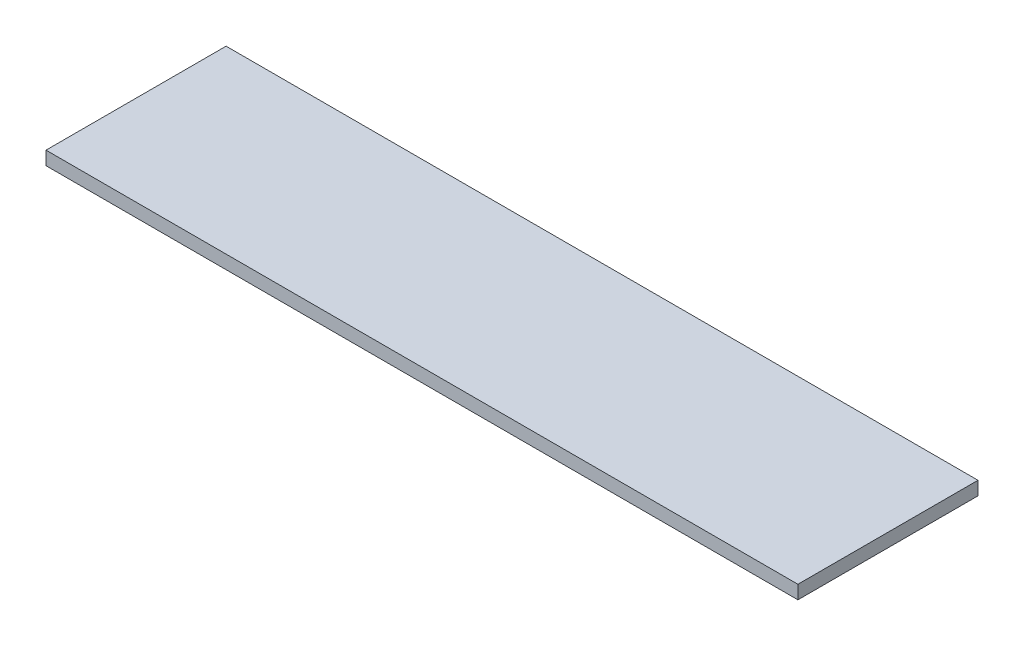
ISO-10303-21;
HEADER;
FILE_DESCRIPTION(('STEP AP214'),'2;1');
FILE_NAME('part.step','',(''),(''),'','','');
FILE_SCHEMA(('AUTOMOTIVE_DESIGN { 1 0 10303 214 1 1 1 1 }'));
ENDSEC;
DATA;
#1=APPLICATION_CONTEXT('core data for automotive mechanical design processes');
#2=APPLICATION_PROTOCOL_DEFINITION('international standard','automotive_design',2000,#1);
#3=PRODUCT_CONTEXT('',#1,'mechanical');
#4=PRODUCT('Part','Part','',(#3));
#5=PRODUCT_RELATED_PRODUCT_CATEGORY('part','',(#4));
#6=PRODUCT_DEFINITION_FORMATION('','',#4);
#7=PRODUCT_DEFINITION_CONTEXT('part definition',#1,'design');
#8=PRODUCT_DEFINITION('design','',#6,#7);
#9=PRODUCT_DEFINITION_SHAPE('','',#8);
#10=(LENGTH_UNIT() NAMED_UNIT(*) SI_UNIT(.MILLI.,.METRE.));
#11=(NAMED_UNIT(*) PLANE_ANGLE_UNIT() SI_UNIT($,.RADIAN.));
#12=(NAMED_UNIT(*) SI_UNIT($,.STERADIAN.) SOLID_ANGLE_UNIT());
#13=UNCERTAINTY_MEASURE_WITH_UNIT(LENGTH_MEASURE(1.E-05),#10,'distance_accuracy_value','');
#14=(GEOMETRIC_REPRESENTATION_CONTEXT(3) GLOBAL_UNCERTAINTY_ASSIGNED_CONTEXT((#13)) GLOBAL_UNIT_ASSIGNED_CONTEXT((#10,
#11,#12)) REPRESENTATION_CONTEXT('',''));
#15=CARTESIAN_POINT('',(0.,0.,0.));
#16=DIRECTION('',(0.,0.,1.));
#17=DIRECTION('',(1.,0.,0.));
#18=AXIS2_PLACEMENT_3D('',#15,#16,#17);
#19=CARTESIAN_POINT('',(530.225,19.05,127.));
#20=DIRECTION('',(-1.,0.,0.));
#21=DIRECTION('',(0.,0.,1.));
#22=AXIS2_PLACEMENT_3D('',#19,#20,#21);
#23=PLANE('',#22);
#24=DIRECTION('',(0.,0.,-1.));
#25=VECTOR('',#24,1.);
#26=CARTESIAN_POINT('',(530.225,0.,127.));
#27=LINE('',#26,#25);
#28=CARTESIAN_POINT('',(530.225,0.,127.));
#29=VERTEX_POINT('',#28);
#30=CARTESIAN_POINT('',(530.225,0.,-127.));
#31=VERTEX_POINT('',#30);
#32=EDGE_CURVE('E96',#29,#31,#27,.T.);
#33=ORIENTED_EDGE('',*,*,#32,.T.);
#34=DIRECTION('',(0.,-1.,0.));
#35=VECTOR('',#34,1.);
#36=CARTESIAN_POINT('',(530.225,19.05,-127.));
#37=LINE('',#36,#35);
#38=CARTESIAN_POINT('',(530.225,19.05,-127.));
#39=VERTEX_POINT('',#38);
#40=EDGE_CURVE('E11',#39,#31,#37,.T.);
#41=ORIENTED_EDGE('',*,*,#40,.F.);
#42=DIRECTION('',(0.,0.,-1.));
#43=VECTOR('',#42,1.);
#44=CARTESIAN_POINT('',(530.225,19.05,127.));
#45=LINE('',#44,#43);
#46=CARTESIAN_POINT('',(530.225,19.05,127.));
#47=VERTEX_POINT('',#46);
#48=EDGE_CURVE('E84',#47,#39,#45,.T.);
#49=ORIENTED_EDGE('',*,*,#48,.F.);
#50=DIRECTION('',(0.,-1.,0.));
#51=VECTOR('',#50,1.);
#52=CARTESIAN_POINT('',(530.225,19.05,127.));
#53=LINE('',#52,#51);
#54=EDGE_CURVE('E92',#47,#29,#53,.T.);
#55=ORIENTED_EDGE('',*,*,#54,.T.);
#56=EDGE_LOOP('',(#33,#41,#49,#55));
#57=FACE_BOUND('',#56,.T.);
#58=ADVANCED_FACE('F33',(#57),#23,.F.);
#59=CARTESIAN_POINT('',(-530.225,19.05,-127.));
#60=DIRECTION('',(0.,0.,1.));
#61=DIRECTION('',(1.,0.,0.));
#62=AXIS2_PLACEMENT_3D('',#59,#60,#61);
#63=PLANE('',#62);
#64=DIRECTION('',(-1.,0.,0.));
#65=VECTOR('',#64,1.);
#66=CARTESIAN_POINT('',(-530.225,0.,-127.));
#67=LINE('',#66,#65);
#68=CARTESIAN_POINT('',(-530.225,0.,-127.));
#69=VERTEX_POINT('',#68);
#70=EDGE_CURVE('E88',#31,#69,#67,.T.);
#71=ORIENTED_EDGE('',*,*,#70,.T.);
#72=DIRECTION('',(0.,-1.,0.));
#73=VECTOR('',#72,1.);
#74=CARTESIAN_POINT('',(-530.225,19.05,-127.));
#75=LINE('',#74,#73);
#76=CARTESIAN_POINT('',(-530.225,19.05,-127.));
#77=VERTEX_POINT('',#76);
#78=EDGE_CURVE('E41',#77,#69,#75,.T.);
#79=ORIENTED_EDGE('',*,*,#78,.F.);
#80=DIRECTION('',(-1.,0.,0.));
#81=VECTOR('',#80,1.);
#82=CARTESIAN_POINT('',(-530.225,19.05,-127.));
#83=LINE('',#82,#81);
#84=EDGE_CURVE('E79',#39,#77,#83,.T.);
#85=ORIENTED_EDGE('',*,*,#84,.F.);
#86=ORIENTED_EDGE('',*,*,#40,.T.);
#87=EDGE_LOOP('',(#71,#79,#85,#86));
#88=FACE_BOUND('',#87,.T.);
#89=ADVANCED_FACE('F87',(#88),#63,.F.);
#90=CARTESIAN_POINT('',(-530.225,19.05,127.));
#91=DIRECTION('',(1.,0.,0.));
#92=DIRECTION('',(0.,0.,-1.));
#93=AXIS2_PLACEMENT_3D('',#90,#91,#92);
#94=PLANE('',#93);
#95=DIRECTION('',(0.,0.,1.));
#96=VECTOR('',#95,1.);
#97=CARTESIAN_POINT('',(-530.225,0.,127.));
#98=LINE('',#97,#96);
#99=CARTESIAN_POINT('',(-530.225,0.,127.));
#100=VERTEX_POINT('',#99);
#101=EDGE_CURVE('E66',#69,#100,#98,.T.);
#102=ORIENTED_EDGE('',*,*,#101,.T.);
#103=DIRECTION('',(0.,-1.,0.));
#104=VECTOR('',#103,1.);
#105=CARTESIAN_POINT('',(-530.225,19.05,127.));
#106=LINE('',#105,#104);
#107=CARTESIAN_POINT('',(-530.225,19.05,127.));
#108=VERTEX_POINT('',#107);
#109=EDGE_CURVE('E89',#108,#100,#106,.T.);
#110=ORIENTED_EDGE('',*,*,#109,.F.);
#111=DIRECTION('',(0.,0.,1.));
#112=VECTOR('',#111,1.);
#113=CARTESIAN_POINT('',(-530.225,19.05,127.));
#114=LINE('',#113,#112);
#115=EDGE_CURVE('E82',#77,#108,#114,.T.);
#116=ORIENTED_EDGE('',*,*,#115,.F.);
#117=ORIENTED_EDGE('',*,*,#78,.T.);
#118=EDGE_LOOP('',(#102,#110,#116,#117));
#119=FACE_BOUND('',#118,.T.);
#120=ADVANCED_FACE('F90',(#119),#94,.F.);
#121=CARTESIAN_POINT('',(-530.225,19.05,127.));
#122=DIRECTION('',(0.,0.,-1.));
#123=DIRECTION('',(-1.,0.,0.));
#124=AXIS2_PLACEMENT_3D('',#121,#122,#123);
#125=PLANE('',#124);
#126=DIRECTION('',(1.,0.,0.));
#127=VECTOR('',#126,1.);
#128=CARTESIAN_POINT('',(-530.225,0.,127.));
#129=LINE('',#128,#127);
#130=EDGE_CURVE('E72',#100,#29,#129,.T.);
#131=ORIENTED_EDGE('',*,*,#130,.T.);
#132=ORIENTED_EDGE('',*,*,#54,.F.);
#133=DIRECTION('',(1.,0.,0.));
#134=VECTOR('',#133,1.);
#135=CARTESIAN_POINT('',(-530.225,19.05,127.));
#136=LINE('',#135,#134);
#137=EDGE_CURVE('E49',#108,#47,#136,.T.);
#138=ORIENTED_EDGE('',*,*,#137,.F.);
#139=ORIENTED_EDGE('',*,*,#109,.T.);
#140=EDGE_LOOP('',(#131,#132,#138,#139));
#141=FACE_BOUND('',#140,.T.);
#142=ADVANCED_FACE('F103',(#141),#125,.F.);
#143=CARTESIAN_POINT('',(0.,19.05,0.));
#144=DIRECTION('',(0.,-1.,0.));
#145=DIRECTION('',(0.,0.,-1.));
#146=AXIS2_PLACEMENT_3D('',#143,#144,#145);
#147=PLANE('',#146);
#148=ORIENTED_EDGE('',*,*,#48,.T.);
#149=ORIENTED_EDGE('',*,*,#84,.T.);
#150=ORIENTED_EDGE('',*,*,#115,.T.);
#151=ORIENTED_EDGE('',*,*,#137,.T.);
#152=EDGE_LOOP('',(#148,#149,#150,#151));
#153=FACE_BOUND('',#152,.T.);
#154=ADVANCED_FACE('F80',(#153),#147,.F.);
#155=CARTESIAN_POINT('',(0.,0.,0.));
#156=DIRECTION('',(0.,-1.,0.));
#157=DIRECTION('',(0.,0.,-1.));
#158=AXIS2_PLACEMENT_3D('',#155,#156,#157);
#159=PLANE('',#158);
#160=ORIENTED_EDGE('',*,*,#32,.F.);
#161=ORIENTED_EDGE('',*,*,#130,.F.);
#162=ORIENTED_EDGE('',*,*,#101,.F.);
#163=ORIENTED_EDGE('',*,*,#70,.F.);
#164=EDGE_LOOP('',(#160,#161,#162,#163));
#165=FACE_BOUND('',#164,.T.);
#166=ADVANCED_FACE('F106',(#165),#159,.T.);
#167=CLOSED_SHELL('',(#58,#89,#120,#142,#154,#166));
#168=MANIFOLD_SOLID_BREP('B2',#167);
#169=ADVANCED_BREP_SHAPE_REPRESENTATION('',(#18,#168),#14);
#170=SHAPE_DEFINITION_REPRESENTATION(#9,#169);
ENDSEC;
END-ISO-10303-21;
